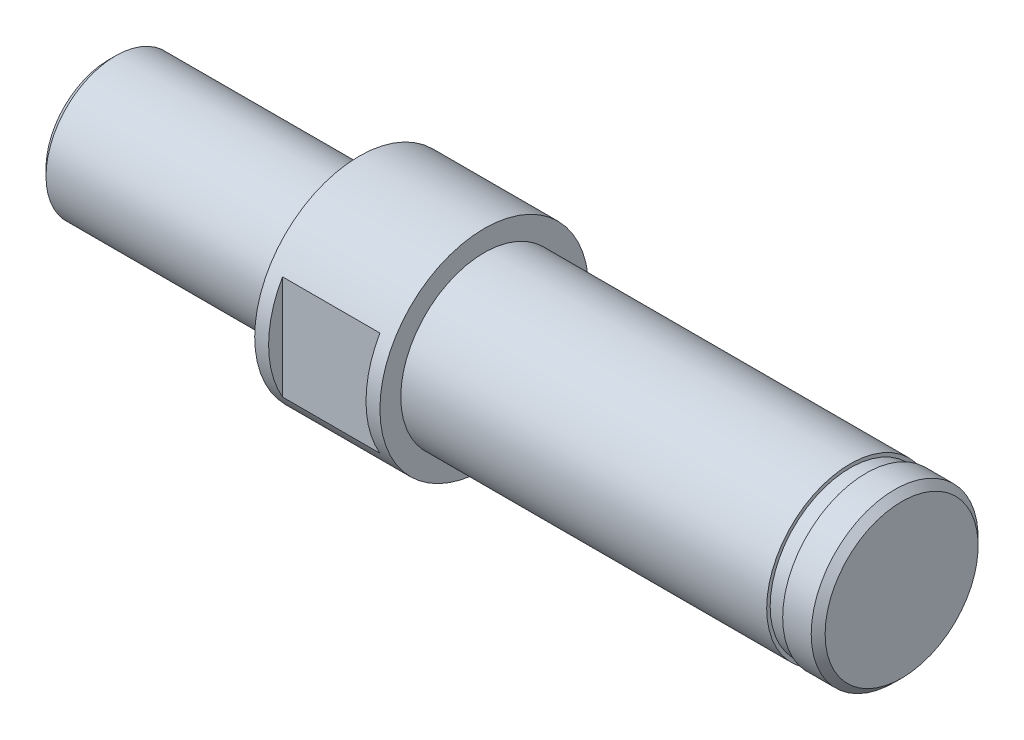
ISO-10303-21;
HEADER;
FILE_DESCRIPTION(('STEP AP214'),'2;1');
FILE_NAME('part.step','',(''),(''),'','','');
FILE_SCHEMA(('AUTOMOTIVE_DESIGN { 1 0 10303 214 1 1 1 1 }'));
ENDSEC;
DATA;
#1=APPLICATION_CONTEXT('core data for automotive mechanical design processes');
#2=APPLICATION_PROTOCOL_DEFINITION('international standard','automotive_design',2000,#1);
#3=PRODUCT_CONTEXT('',#1,'mechanical');
#4=PRODUCT('Part','Part','',(#3));
#5=PRODUCT_RELATED_PRODUCT_CATEGORY('part','',(#4));
#6=PRODUCT_DEFINITION_FORMATION('','',#4);
#7=PRODUCT_DEFINITION_CONTEXT('part definition',#1,'design');
#8=PRODUCT_DEFINITION('design','',#6,#7);
#9=PRODUCT_DEFINITION_SHAPE('','',#8);
#10=(LENGTH_UNIT() NAMED_UNIT(*) SI_UNIT(.MILLI.,.METRE.));
#11=(NAMED_UNIT(*) PLANE_ANGLE_UNIT() SI_UNIT($,.RADIAN.));
#12=(NAMED_UNIT(*) SI_UNIT($,.STERADIAN.) SOLID_ANGLE_UNIT());
#13=UNCERTAINTY_MEASURE_WITH_UNIT(LENGTH_MEASURE(1.E-05),#10,'distance_accuracy_value','');
#14=(GEOMETRIC_REPRESENTATION_CONTEXT(3) GLOBAL_UNCERTAINTY_ASSIGNED_CONTEXT((#13)) GLOBAL_UNIT_ASSIGNED_CONTEXT((#10,
#11,#12)) REPRESENTATION_CONTEXT('',''));
#15=CARTESIAN_POINT('',(0.,0.,0.));
#16=DIRECTION('',(0.,0.,1.));
#17=DIRECTION('',(1.,0.,0.));
#18=AXIS2_PLACEMENT_3D('',#15,#16,#17);
#19=CARTESIAN_POINT('',(-21.9806151153687,0.,0.));
#20=DIRECTION('',(-1.,0.,0.));
#21=DIRECTION('',(0.,0.,1.));
#22=AXIS2_PLACEMENT_3D('',#19,#20,#21);
#23=CYLINDRICAL_SURFACE('',#22,6.);
#24=CARTESIAN_POINT('',(9.,0.,0.));
#25=DIRECTION('',(-1.,0.,0.));
#26=DIRECTION('',(0.,0.,1.));
#27=AXIS2_PLACEMENT_3D('',#24,#25,#26);
#28=CIRCLE('',#27,6.);
#29=CARTESIAN_POINT('',(9.,0.,6.));
#30=VERTEX_POINT('',#29);
#31=EDGE_CURVE('E208',#30,#30,#28,.T.);
#32=ORIENTED_EDGE('',*,*,#31,.F.);
#33=EDGE_LOOP('',(#32));
#34=FACE_BOUND('',#33,.T.);
#35=CARTESIAN_POINT('',(35.3,0.,0.));
#36=DIRECTION('',(-1.,0.,0.));
#37=DIRECTION('',(0.,0.,1.));
#38=AXIS2_PLACEMENT_3D('',#35,#36,#37);
#39=CIRCLE('',#38,6.);
#40=CARTESIAN_POINT('',(35.3,0.,6.));
#41=VERTEX_POINT('',#40);
#42=EDGE_CURVE('E199',#41,#41,#39,.T.);
#43=ORIENTED_EDGE('',*,*,#42,.T.);
#44=EDGE_LOOP('',(#43));
#45=FACE_BOUND('',#44,.T.);
#46=ADVANCED_FACE('F39',(#34,#45),#23,.T.);
#47=CARTESIAN_POINT('',(-18.,0.,0.));
#48=DIRECTION('',(1.,0.,0.));
#49=DIRECTION('',(0.,0.,-1.));
#50=AXIS2_PLACEMENT_3D('',#47,#48,#49);
#51=PLANE('',#50);
#52=CARTESIAN_POINT('',(-18.,0.,0.));
#53=DIRECTION('',(1.,0.,0.));
#54=DIRECTION('',(0.,0.,-1.));
#55=AXIS2_PLACEMENT_3D('',#52,#53,#54);
#56=CIRCLE('',#55,4.49999999999998);
#57=CARTESIAN_POINT('',(-18.,0.,-4.49999999999998));
#58=VERTEX_POINT('',#57);
#59=EDGE_CURVE('E116',#58,#58,#56,.F.);
#60=ORIENTED_EDGE('',*,*,#59,.T.);
#61=EDGE_LOOP('',(#60));
#62=FACE_BOUND('',#61,.T.);
#63=ADVANCED_FACE('F137',(#62),#51,.F.);
#64=CARTESIAN_POINT('',(-21.9806151153687,0.,0.));
#65=DIRECTION('',(-1.,0.,0.));
#66=DIRECTION('',(0.,0.,1.));
#67=AXIS2_PLACEMENT_3D('',#64,#65,#66);
#68=CYLINDRICAL_SURFACE('',#67,5.);
#69=CARTESIAN_POINT('',(-17.5,0.,0.));
#70=DIRECTION('',(1.,0.,0.));
#71=DIRECTION('',(0.,0.,-1.));
#72=AXIS2_PLACEMENT_3D('',#69,#70,#71);
#73=CIRCLE('',#72,5.);
#74=CARTESIAN_POINT('',(-17.5,0.,-5.));
#75=VERTEX_POINT('',#74);
#76=EDGE_CURVE('E119',#75,#75,#73,.T.);
#77=ORIENTED_EDGE('',*,*,#76,.T.);
#78=EDGE_LOOP('',(#77));
#79=FACE_BOUND('',#78,.T.);
#80=CARTESIAN_POINT('',(0.,0.,0.));
#81=DIRECTION('',(-1.,0.,0.));
#82=DIRECTION('',(0.,0.,1.));
#83=AXIS2_PLACEMENT_3D('',#80,#81,#82);
#84=CIRCLE('',#83,5.);
#85=CARTESIAN_POINT('',(0.,0.,5.));
#86=VERTEX_POINT('',#85);
#87=EDGE_CURVE('E88',#86,#86,#84,.T.);
#88=ORIENTED_EDGE('',*,*,#87,.T.);
#89=EDGE_LOOP('',(#88));
#90=FACE_BOUND('',#89,.T.);
#91=ADVANCED_FACE('F143',(#79,#90),#68,.T.);
#92=CARTESIAN_POINT('',(0.,5.,0.));
#93=DIRECTION('',(1.,0.,0.));
#94=DIRECTION('',(0.,0.,-1.));
#95=AXIS2_PLACEMENT_3D('',#92,#93,#94);
#96=PLANE('',#95);
#97=ORIENTED_EDGE('',*,*,#87,.F.);
#98=EDGE_LOOP('',(#97));
#99=FACE_BOUND('',#98,.T.);
#100=CARTESIAN_POINT('',(0.,0.,0.));
#101=DIRECTION('',(-1.,0.,0.));
#102=DIRECTION('',(0.,0.,1.));
#103=AXIS2_PLACEMENT_3D('',#100,#101,#102);
#104=CIRCLE('',#103,7.5);
#105=CARTESIAN_POINT('',(0.,0.,7.5));
#106=VERTEX_POINT('',#105);
#107=EDGE_CURVE('E214',#106,#106,#104,.T.);
#108=ORIENTED_EDGE('',*,*,#107,.T.);
#109=EDGE_LOOP('',(#108));
#110=FACE_BOUND('',#109,.T.);
#111=ADVANCED_FACE('F223',(#99,#110),#96,.F.);
#112=CARTESIAN_POINT('',(-21.9806151153687,0.,0.));
#113=DIRECTION('',(-1.,0.,0.));
#114=DIRECTION('',(0.,0.,1.));
#115=AXIS2_PLACEMENT_3D('',#112,#113,#114);
#116=CYLINDRICAL_SURFACE('',#115,7.5);
#117=CARTESIAN_POINT('',(8.,0.,0.));
#118=DIRECTION('',(1.,0.,0.));
#119=DIRECTION('',(0.,0.,-1.));
#120=AXIS2_PLACEMENT_3D('',#117,#118,#119);
#121=CIRCLE('',#120,7.5);
#122=CARTESIAN_POINT('',(8.,-3.74165738677394,-6.49999999999995));
#123=VERTEX_POINT('',#122);
#124=CARTESIAN_POINT('',(8.,3.74165738677394,-6.49999999999995));
#125=VERTEX_POINT('',#124);
#126=EDGE_CURVE('E101',#123,#125,#121,.T.);
#127=ORIENTED_EDGE('',*,*,#126,.T.);
#128=DIRECTION('',(-1.,0.,0.));
#129=VECTOR('',#128,1.);
#130=CARTESIAN_POINT('',(-21.9806151153687,3.74165738677394,-6.49999999999995));
#131=LINE('',#130,#129);
#132=CARTESIAN_POINT('',(1.,3.74165738677394,-6.49999999999995));
#133=VERTEX_POINT('',#132);
#134=EDGE_CURVE('E108',#125,#133,#131,.T.);
#135=ORIENTED_EDGE('',*,*,#134,.T.);
#136=CARTESIAN_POINT('',(1.,0.,0.));
#137=DIRECTION('',(1.,0.,0.));
#138=DIRECTION('',(0.,0.,-1.));
#139=AXIS2_PLACEMENT_3D('',#136,#137,#138);
#140=CIRCLE('',#139,7.5);
#141=CARTESIAN_POINT('',(1.,-3.74165738677394,-6.49999999999995));
#142=VERTEX_POINT('',#141);
#143=EDGE_CURVE('E99',#142,#133,#140,.T.);
#144=ORIENTED_EDGE('',*,*,#143,.F.);
#145=DIRECTION('',(-1.,0.,0.));
#146=VECTOR('',#145,1.);
#147=CARTESIAN_POINT('',(-21.9806151153687,-3.74165738677394,-6.49999999999995));
#148=LINE('',#147,#146);
#149=EDGE_CURVE('E102',#142,#123,#148,.F.);
#150=ORIENTED_EDGE('',*,*,#149,.T.);
#151=EDGE_LOOP('',(#127,#135,#144,#150));
#152=FACE_BOUND('',#151,.T.);
#153=CARTESIAN_POINT('',(8.,3.74165738677394,6.49999999999995));
#154=VERTEX_POINT('',#153);
#155=CARTESIAN_POINT('',(8.,-3.74165738677394,6.49999999999995));
#156=VERTEX_POINT('',#155);
#157=EDGE_CURVE('E97',#154,#156,#121,.T.);
#158=ORIENTED_EDGE('',*,*,#157,.T.);
#159=DIRECTION('',(-1.,0.,0.));
#160=VECTOR('',#159,1.);
#161=CARTESIAN_POINT('',(-21.9806151153687,-3.74165738677394,6.49999999999995));
#162=LINE('',#161,#160);
#163=CARTESIAN_POINT('',(1.,-3.74165738677394,6.49999999999995));
#164=VERTEX_POINT('',#163);
#165=EDGE_CURVE('E96',#156,#164,#162,.T.);
#166=ORIENTED_EDGE('',*,*,#165,.T.);
#167=CARTESIAN_POINT('',(1.,3.74165738677394,6.49999999999995));
#168=VERTEX_POINT('',#167);
#169=EDGE_CURVE('E87',#168,#164,#140,.T.);
#170=ORIENTED_EDGE('',*,*,#169,.F.);
#171=DIRECTION('',(-1.,0.,0.));
#172=VECTOR('',#171,1.);
#173=CARTESIAN_POINT('',(-21.9806151153687,3.74165738677394,6.49999999999995));
#174=LINE('',#173,#172);
#175=EDGE_CURVE('E79',#168,#154,#174,.F.);
#176=ORIENTED_EDGE('',*,*,#175,.T.);
#177=EDGE_LOOP('',(#158,#166,#170,#176));
#178=FACE_BOUND('',#177,.T.);
#179=ORIENTED_EDGE('',*,*,#107,.F.);
#180=EDGE_LOOP('',(#179));
#181=FACE_BOUND('',#180,.T.);
#182=CARTESIAN_POINT('',(9.,0.,0.));
#183=DIRECTION('',(-1.,0.,0.));
#184=DIRECTION('',(0.,0.,1.));
#185=AXIS2_PLACEMENT_3D('',#182,#183,#184);
#186=CIRCLE('',#185,7.5);
#187=CARTESIAN_POINT('',(9.,0.,7.5));
#188=VERTEX_POINT('',#187);
#189=EDGE_CURVE('E211',#188,#188,#186,.T.);
#190=ORIENTED_EDGE('',*,*,#189,.T.);
#191=EDGE_LOOP('',(#190));
#192=FACE_BOUND('',#191,.T.);
#193=ADVANCED_FACE('F94',(#152,#178,#181,#192),#116,.T.);
#194=CARTESIAN_POINT('',(9.,7.50000000000001,0.));
#195=DIRECTION('',(-1.,0.,0.));
#196=DIRECTION('',(0.,0.,1.));
#197=AXIS2_PLACEMENT_3D('',#194,#195,#196);
#198=PLANE('',#197);
#199=ORIENTED_EDGE('',*,*,#189,.F.);
#200=EDGE_LOOP('',(#199));
#201=FACE_BOUND('',#200,.T.);
#202=ORIENTED_EDGE('',*,*,#31,.T.);
#203=EDGE_LOOP('',(#202));
#204=FACE_BOUND('',#203,.T.);
#205=ADVANCED_FACE('F169',(#201,#204),#198,.F.);
#206=CARTESIAN_POINT('',(36.45,6.00000000000001,0.));
#207=DIRECTION('',(-1.,0.,0.));
#208=DIRECTION('',(0.,0.,1.));
#209=AXIS2_PLACEMENT_3D('',#206,#207,#208);
#210=PLANE('',#209);
#211=CARTESIAN_POINT('',(36.45,0.,0.));
#212=DIRECTION('',(-1.,0.,0.));
#213=DIRECTION('',(0.,0.,1.));
#214=AXIS2_PLACEMENT_3D('',#211,#212,#213);
#215=CIRCLE('',#214,6.);
#216=CARTESIAN_POINT('',(36.45,0.,6.));
#217=VERTEX_POINT('',#216);
#218=EDGE_CURVE('E196',#217,#217,#215,.T.);
#219=ORIENTED_EDGE('',*,*,#218,.T.);
#220=EDGE_LOOP('',(#219));
#221=FACE_BOUND('',#220,.T.);
#222=CARTESIAN_POINT('',(36.45,0.,0.));
#223=DIRECTION('',(-1.,0.,0.));
#224=DIRECTION('',(0.,0.,1.));
#225=AXIS2_PLACEMENT_3D('',#222,#223,#224);
#226=CIRCLE('',#225,5.75);
#227=CARTESIAN_POINT('',(36.45,0.,5.75));
#228=VERTEX_POINT('',#227);
#229=EDGE_CURVE('E205',#228,#228,#226,.T.);
#230=ORIENTED_EDGE('',*,*,#229,.F.);
#231=EDGE_LOOP('',(#230));
#232=FACE_BOUND('',#231,.T.);
#233=ADVANCED_FACE('F166',(#221,#232),#210,.T.);
#234=CARTESIAN_POINT('',(-19.4038469423102,0.,0.));
#235=DIRECTION('',(-1.,0.,0.));
#236=DIRECTION('',(0.,0.,1.));
#237=AXIS2_PLACEMENT_3D('',#234,#235,#236);
#238=CYLINDRICAL_SURFACE('',#237,5.75);
#239=ORIENTED_EDGE('',*,*,#229,.T.);
#240=EDGE_LOOP('',(#239));
#241=FACE_BOUND('',#240,.T.);
#242=CARTESIAN_POINT('',(35.3,0.,0.));
#243=DIRECTION('',(-1.,0.,0.));
#244=DIRECTION('',(0.,0.,1.));
#245=AXIS2_PLACEMENT_3D('',#242,#243,#244);
#246=CIRCLE('',#245,5.75);
#247=CARTESIAN_POINT('',(35.3,0.,5.75));
#248=VERTEX_POINT('',#247);
#249=EDGE_CURVE('E202',#248,#248,#246,.T.);
#250=ORIENTED_EDGE('',*,*,#249,.F.);
#251=EDGE_LOOP('',(#250));
#252=FACE_BOUND('',#251,.T.);
#253=ADVANCED_FACE('F162',(#241,#252),#238,.T.);
#254=CARTESIAN_POINT('',(35.3,6.00000000000001,0.));
#255=DIRECTION('',(1.,0.,0.));
#256=DIRECTION('',(0.,0.,-1.));
#257=AXIS2_PLACEMENT_3D('',#254,#255,#256);
#258=PLANE('',#257);
#259=ORIENTED_EDGE('',*,*,#249,.T.);
#260=EDGE_LOOP('',(#259));
#261=FACE_BOUND('',#260,.T.);
#262=ORIENTED_EDGE('',*,*,#42,.F.);
#263=EDGE_LOOP('',(#262));
#264=FACE_BOUND('',#263,.T.);
#265=ADVANCED_FACE('F157',(#261,#264),#258,.T.);
#266=CARTESIAN_POINT('',(39.,6.00000000000001,0.));
#267=DIRECTION('',(-1.,0.,0.));
#268=DIRECTION('',(0.,0.,1.));
#269=AXIS2_PLACEMENT_3D('',#266,#267,#268);
#270=PLANE('',#269);
#271=CARTESIAN_POINT('',(39.,0.,0.));
#272=DIRECTION('',(-1.,0.,0.));
#273=DIRECTION('',(0.,0.,1.));
#274=AXIS2_PLACEMENT_3D('',#271,#272,#273);
#275=CIRCLE('',#274,5.50000000000001);
#276=CARTESIAN_POINT('',(39.,0.,5.50000000000001));
#277=VERTEX_POINT('',#276);
#278=EDGE_CURVE('E12',#277,#277,#275,.F.);
#279=ORIENTED_EDGE('',*,*,#278,.T.);
#280=EDGE_LOOP('',(#279));
#281=FACE_BOUND('',#280,.T.);
#282=ADVANCED_FACE('F151',(#281),#270,.F.);
#283=CARTESIAN_POINT('',(38.5,0.,0.));
#284=DIRECTION('',(-1.,0.,0.));
#285=DIRECTION('',(0.,0.,1.));
#286=AXIS2_PLACEMENT_3D('',#283,#284,#285);
#287=CIRCLE('',#286,6.);
#288=CARTESIAN_POINT('',(38.5,0.,6.));
#289=VERTEX_POINT('',#288);
#290=EDGE_CURVE('E47',#289,#289,#287,.T.);
#291=ORIENTED_EDGE('',*,*,#290,.T.);
#292=EDGE_LOOP('',(#291));
#293=FACE_BOUND('',#292,.T.);
#294=ORIENTED_EDGE('',*,*,#218,.F.);
#295=EDGE_LOOP('',(#294));
#296=FACE_BOUND('',#295,.T.);
#297=ADVANCED_FACE('F124',(#293,#296),#23,.T.);
#298=CARTESIAN_POINT('',(8.,-7.50000000000001,6.49999999999995));
#299=DIRECTION('',(0.,0.,-1.));
#300=DIRECTION('',(-1.,0.,0.));
#301=AXIS2_PLACEMENT_3D('',#298,#299,#300);
#302=PLANE('',#301);
#303=DIRECTION('',(0.,-1.,0.));
#304=VECTOR('',#303,1.);
#305=CARTESIAN_POINT('',(8.,-7.50000000000001,6.49999999999995));
#306=LINE('',#305,#304);
#307=EDGE_CURVE('E62',#154,#156,#306,.T.);
#308=ORIENTED_EDGE('',*,*,#307,.F.);
#309=ORIENTED_EDGE('',*,*,#175,.F.);
#310=DIRECTION('',(0.,-1.,0.));
#311=VECTOR('',#310,1.);
#312=CARTESIAN_POINT('',(1.,-7.50000000000001,6.49999999999995));
#313=LINE('',#312,#311);
#314=EDGE_CURVE('E82',#168,#164,#313,.T.);
#315=ORIENTED_EDGE('',*,*,#314,.T.);
#316=ORIENTED_EDGE('',*,*,#165,.F.);
#317=EDGE_LOOP('',(#308,#309,#315,#316));
#318=FACE_BOUND('',#317,.T.);
#319=ADVANCED_FACE('F81',(#318),#302,.F.);
#320=CARTESIAN_POINT('',(1.,-0.0199050959356351,0.));
#321=DIRECTION('',(1.,0.,0.));
#322=DIRECTION('',(0.,0.,-1.));
#323=AXIS2_PLACEMENT_3D('',#320,#321,#322);
#324=PLANE('',#323);
#325=ORIENTED_EDGE('',*,*,#169,.T.);
#326=ORIENTED_EDGE('',*,*,#314,.F.);
#327=EDGE_LOOP('',(#325,#326));
#328=FACE_BOUND('',#327,.T.);
#329=ADVANCED_FACE('F91',(#328),#324,.T.);
#330=CARTESIAN_POINT('',(8.,-0.0199050959356351,0.));
#331=DIRECTION('',(1.,0.,0.));
#332=DIRECTION('',(0.,0.,-1.));
#333=AXIS2_PLACEMENT_3D('',#330,#331,#332);
#334=PLANE('',#333);
#335=ORIENTED_EDGE('',*,*,#307,.T.);
#336=ORIENTED_EDGE('',*,*,#157,.F.);
#337=EDGE_LOOP('',(#335,#336));
#338=FACE_BOUND('',#337,.T.);
#339=ADVANCED_FACE('F176',(#338),#334,.F.);
#340=DIRECTION('',(0.,1.,0.));
#341=VECTOR('',#340,1.);
#342=CARTESIAN_POINT('',(8.,-7.50000000000001,-6.49999999999995));
#343=LINE('',#342,#341);
#344=EDGE_CURVE('E54',#123,#125,#343,.T.);
#345=ORIENTED_EDGE('',*,*,#344,.T.);
#346=ORIENTED_EDGE('',*,*,#126,.F.);
#347=EDGE_LOOP('',(#345,#346));
#348=FACE_BOUND('',#347,.T.);
#349=ADVANCED_FACE('F180',(#348),#334,.F.);
#350=ORIENTED_EDGE('',*,*,#143,.T.);
#351=DIRECTION('',(0.,1.,0.));
#352=VECTOR('',#351,1.);
#353=CARTESIAN_POINT('',(1.,-7.50000000000001,-6.49999999999995));
#354=LINE('',#353,#352);
#355=EDGE_CURVE('E92',#142,#133,#354,.T.);
#356=ORIENTED_EDGE('',*,*,#355,.F.);
#357=EDGE_LOOP('',(#350,#356));
#358=FACE_BOUND('',#357,.T.);
#359=ADVANCED_FACE('F177',(#358),#324,.T.);
#360=CARTESIAN_POINT('',(8.,-7.50000000000001,-6.49999999999995));
#361=DIRECTION('',(0.,0.,1.));
#362=DIRECTION('',(1.,0.,0.));
#363=AXIS2_PLACEMENT_3D('',#360,#361,#362);
#364=PLANE('',#363);
#365=ORIENTED_EDGE('',*,*,#344,.F.);
#366=ORIENTED_EDGE('',*,*,#149,.F.);
#367=ORIENTED_EDGE('',*,*,#355,.T.);
#368=ORIENTED_EDGE('',*,*,#134,.F.);
#369=EDGE_LOOP('',(#365,#366,#367,#368));
#370=FACE_BOUND('',#369,.T.);
#371=ADVANCED_FACE('F133',(#370),#364,.F.);
#372=CARTESIAN_POINT('',(-18.,0.,0.));
#373=DIRECTION('',(1.,0.,0.));
#374=DIRECTION('',(0.,0.,-1.));
#375=AXIS2_PLACEMENT_3D('',#372,#373,#374);
#376=CONICAL_SURFACE('',#375,4.49999999999998,0.785398163397451);
#377=ORIENTED_EDGE('',*,*,#76,.F.);
#378=EDGE_LOOP('',(#377));
#379=FACE_BOUND('',#378,.T.);
#380=ORIENTED_EDGE('',*,*,#59,.F.);
#381=EDGE_LOOP('',(#380));
#382=FACE_BOUND('',#381,.T.);
#383=ADVANCED_FACE('F128',(#379,#382),#376,.T.);
#384=CARTESIAN_POINT('',(38.5,0.,0.));
#385=DIRECTION('',(-1.,0.,0.));
#386=DIRECTION('',(0.,0.,1.));
#387=AXIS2_PLACEMENT_3D('',#384,#385,#386);
#388=CONICAL_SURFACE('',#387,6.,0.78539816339745);
#389=ORIENTED_EDGE('',*,*,#278,.F.);
#390=EDGE_LOOP('',(#389));
#391=FACE_BOUND('',#390,.T.);
#392=ORIENTED_EDGE('',*,*,#290,.F.);
#393=EDGE_LOOP('',(#392));
#394=FACE_BOUND('',#393,.T.);
#395=ADVANCED_FACE('F41',(#391,#394),#388,.T.);
#396=CLOSED_SHELL('',(#46,#63,#91,#111,#193,#205,#233,#253,#265,#282,#297,#319,#329,#339,#349,
#359,#371,#383,#395));
#397=MANIFOLD_SOLID_BREP('B2',#396);
#398=ADVANCED_BREP_SHAPE_REPRESENTATION('',(#18,#397),#14);
#399=SHAPE_DEFINITION_REPRESENTATION(#9,#398);
ENDSEC;
END-ISO-10303-21;
